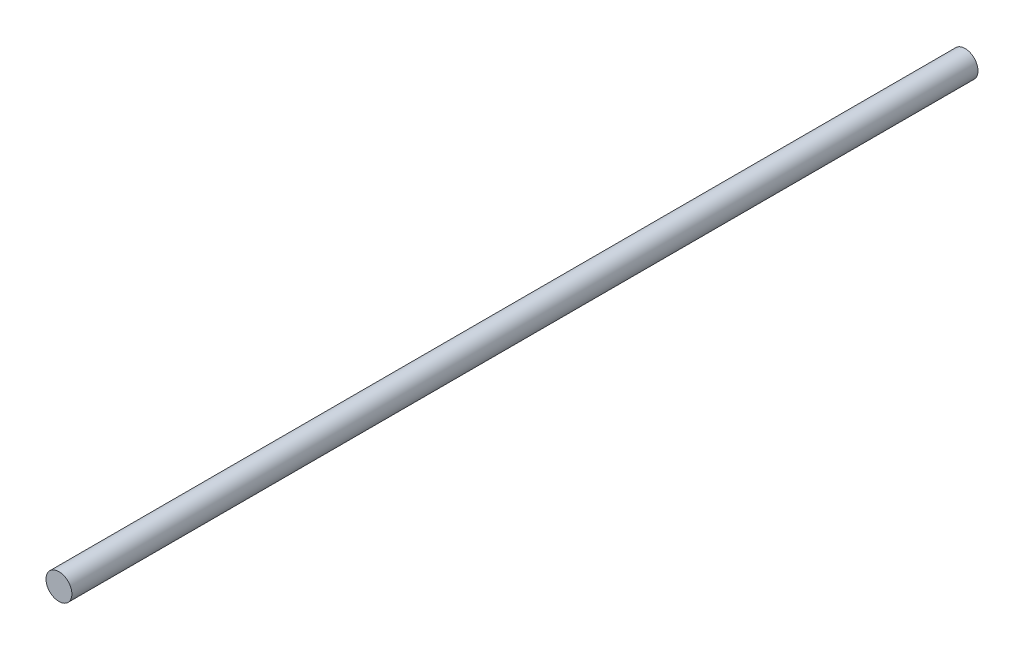
ISO-10303-21;
HEADER;
FILE_DESCRIPTION(('STEP AP214'),'2;1');
FILE_NAME('part.step','',(''),(''),'','','');
FILE_SCHEMA(('AUTOMOTIVE_DESIGN { 1 0 10303 214 1 1 1 1 }'));
ENDSEC;
DATA;
#1=APPLICATION_CONTEXT('core data for automotive mechanical design processes');
#2=APPLICATION_PROTOCOL_DEFINITION('international standard','automotive_design',2000,#1);
#3=PRODUCT_CONTEXT('',#1,'mechanical');
#4=PRODUCT('Part','Part','',(#3));
#5=PRODUCT_RELATED_PRODUCT_CATEGORY('part','',(#4));
#6=PRODUCT_DEFINITION_FORMATION('','',#4);
#7=PRODUCT_DEFINITION_CONTEXT('part definition',#1,'design');
#8=PRODUCT_DEFINITION('design','',#6,#7);
#9=PRODUCT_DEFINITION_SHAPE('','',#8);
#10=(LENGTH_UNIT() NAMED_UNIT(*) SI_UNIT(.MILLI.,.METRE.));
#11=(NAMED_UNIT(*) PLANE_ANGLE_UNIT() SI_UNIT($,.RADIAN.));
#12=(NAMED_UNIT(*) SI_UNIT($,.STERADIAN.) SOLID_ANGLE_UNIT());
#13=UNCERTAINTY_MEASURE_WITH_UNIT(LENGTH_MEASURE(1.E-05),#10,'distance_accuracy_value','');
#14=(GEOMETRIC_REPRESENTATION_CONTEXT(3) GLOBAL_UNCERTAINTY_ASSIGNED_CONTEXT((#13)) GLOBAL_UNIT_ASSIGNED_CONTEXT((#10,
#11,#12)) REPRESENTATION_CONTEXT('',''));
#15=CARTESIAN_POINT('',(0.,0.,0.));
#16=DIRECTION('',(0.,0.,1.));
#17=DIRECTION('',(1.,0.,0.));
#18=AXIS2_PLACEMENT_3D('',#15,#16,#17);
#19=CARTESIAN_POINT('',(0.,0.,280.));
#20=DIRECTION('',(0.,0.,-1.));
#21=DIRECTION('',(-1.,0.,0.));
#22=AXIS2_PLACEMENT_3D('',#19,#20,#21);
#23=CYLINDRICAL_SURFACE('',#22,4.);
#24=CARTESIAN_POINT('',(0.,0.,280.));
#25=DIRECTION('',(0.,0.,1.));
#26=DIRECTION('',(1.,0.,0.));
#27=AXIS2_PLACEMENT_3D('',#24,#25,#26);
#28=CIRCLE('',#27,4.);
#29=CARTESIAN_POINT('',(4.,0.,280.));
#30=VERTEX_POINT('',#29);
#31=EDGE_CURVE('E10',#30,#30,#28,.T.);
#32=ORIENTED_EDGE('',*,*,#31,.F.);
#33=EDGE_LOOP('',(#32));
#34=FACE_BOUND('',#33,.T.);
#35=CARTESIAN_POINT('',(0.,0.,0.));
#36=DIRECTION('',(0.,0.,1.));
#37=DIRECTION('',(1.,0.,0.));
#38=AXIS2_PLACEMENT_3D('',#35,#36,#37);
#39=CIRCLE('',#38,4.);
#40=CARTESIAN_POINT('',(4.,0.,0.));
#41=VERTEX_POINT('',#40);
#42=EDGE_CURVE('E32',#41,#41,#39,.T.);
#43=ORIENTED_EDGE('',*,*,#42,.T.);
#44=EDGE_LOOP('',(#43));
#45=FACE_BOUND('',#44,.T.);
#46=ADVANCED_FACE('F29',(#34,#45),#23,.T.);
#47=CARTESIAN_POINT('',(0.,0.,280.));
#48=DIRECTION('',(0.,0.,1.));
#49=DIRECTION('',(1.,0.,0.));
#50=AXIS2_PLACEMENT_3D('',#47,#48,#49);
#51=PLANE('',#50);
#52=ORIENTED_EDGE('',*,*,#31,.T.);
#53=EDGE_LOOP('',(#52));
#54=FACE_BOUND('',#53,.T.);
#55=ADVANCED_FACE('F44',(#54),#51,.T.);
#56=CARTESIAN_POINT('',(0.,0.,0.));
#57=DIRECTION('',(0.,0.,1.));
#58=DIRECTION('',(1.,0.,0.));
#59=AXIS2_PLACEMENT_3D('',#56,#57,#58);
#60=PLANE('',#59);
#61=ORIENTED_EDGE('',*,*,#42,.F.);
#62=EDGE_LOOP('',(#61));
#63=FACE_BOUND('',#62,.T.);
#64=ADVANCED_FACE('F42',(#63),#60,.F.);
#65=CLOSED_SHELL('',(#46,#55,#64));
#66=MANIFOLD_SOLID_BREP('B2',#65);
#67=ADVANCED_BREP_SHAPE_REPRESENTATION('',(#18,#66),#14);
#68=SHAPE_DEFINITION_REPRESENTATION(#9,#67);
ENDSEC;
END-ISO-10303-21;
